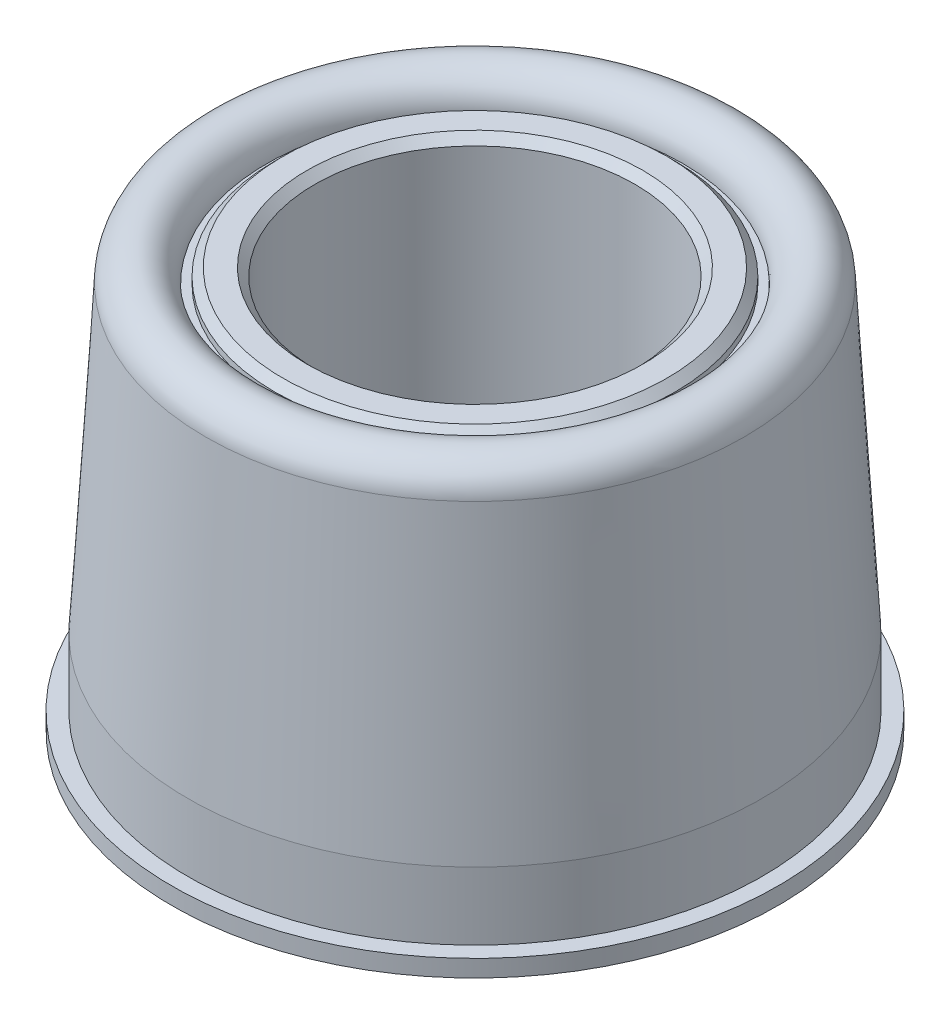
ISO-10303-21;
HEADER;
FILE_DESCRIPTION(('STEP AP214'),'2;1');
FILE_NAME('part.step','',(''),(''),'','','');
FILE_SCHEMA(('AUTOMOTIVE_DESIGN { 1 0 10303 214 1 1 1 1 }'));
ENDSEC;
DATA;
#1=APPLICATION_CONTEXT('core data for automotive mechanical design processes');
#2=APPLICATION_PROTOCOL_DEFINITION('international standard','automotive_design',2000,#1);
#3=PRODUCT_CONTEXT('',#1,'mechanical');
#4=PRODUCT('Part','Part','',(#3));
#5=PRODUCT_RELATED_PRODUCT_CATEGORY('part','',(#4));
#6=PRODUCT_DEFINITION_FORMATION('','',#4);
#7=PRODUCT_DEFINITION_CONTEXT('part definition',#1,'design');
#8=PRODUCT_DEFINITION('design','',#6,#7);
#9=PRODUCT_DEFINITION_SHAPE('','',#8);
#10=(LENGTH_UNIT() NAMED_UNIT(*) SI_UNIT(.MILLI.,.METRE.));
#11=(NAMED_UNIT(*) PLANE_ANGLE_UNIT() SI_UNIT($,.RADIAN.));
#12=(NAMED_UNIT(*) SI_UNIT($,.STERADIAN.) SOLID_ANGLE_UNIT());
#13=UNCERTAINTY_MEASURE_WITH_UNIT(LENGTH_MEASURE(1.E-05),#10,'distance_accuracy_value','');
#14=(GEOMETRIC_REPRESENTATION_CONTEXT(3) GLOBAL_UNCERTAINTY_ASSIGNED_CONTEXT((#13)) GLOBAL_UNIT_ASSIGNED_CONTEXT((#10,
#11,#12)) REPRESENTATION_CONTEXT('',''));
#15=CARTESIAN_POINT('',(0.,0.,0.));
#16=DIRECTION('',(0.,0.,1.));
#17=DIRECTION('',(1.,0.,0.));
#18=AXIS2_PLACEMENT_3D('',#15,#16,#17);
#19=CARTESIAN_POINT('',(0.,-9.0424,0.));
#20=DIRECTION('',(0.,-1.,0.));
#21=DIRECTION('',(0.,0.,-1.));
#22=AXIS2_PLACEMENT_3D('',#19,#20,#21);
#23=CYLINDRICAL_SURFACE('',#22,9.78);
#24=CARTESIAN_POINT('',(0.,-9.80000000000001,0.));
#25=DIRECTION('',(0.,-1.,0.));
#26=DIRECTION('',(0.,0.,-1.));
#27=AXIS2_PLACEMENT_3D('',#24,#25,#26);
#28=CIRCLE('',#27,9.78);
#29=CARTESIAN_POINT('',(0.,-9.80000000000001,-9.78));
#30=VERTEX_POINT('',#29);
#31=EDGE_CURVE('E41',#30,#30,#28,.T.);
#32=ORIENTED_EDGE('',*,*,#31,.T.);
#33=EDGE_LOOP('',(#32));
#34=FACE_BOUND('',#33,.T.);
#35=CARTESIAN_POINT('',(0.,-9.,0.));
#36=DIRECTION('',(0.,1.,0.));
#37=DIRECTION('',(0.,0.,1.));
#38=AXIS2_PLACEMENT_3D('',#35,#36,#37);
#39=CIRCLE('',#38,9.78);
#40=CARTESIAN_POINT('',(0.,-9.,9.78));
#41=VERTEX_POINT('',#40);
#42=EDGE_CURVE('E10',#41,#41,#39,.F.);
#43=ORIENTED_EDGE('',*,*,#42,.F.);
#44=EDGE_LOOP('',(#43));
#45=FACE_BOUND('',#44,.T.);
#46=ADVANCED_FACE('F34',(#34,#45),#23,.F.);
#47=CARTESIAN_POINT('',(-9.78,-9.8,0.));
#48=DIRECTION('',(0.,1.,0.));
#49=DIRECTION('',(0.,0.,1.));
#50=AXIS2_PLACEMENT_3D('',#47,#48,#49);
#51=PLANE('',#50);
#52=ORIENTED_EDGE('',*,*,#31,.F.);
#53=EDGE_LOOP('',(#52));
#54=FACE_BOUND('',#53,.T.);
#55=CARTESIAN_POINT('',(0.,-9.8,0.));
#56=DIRECTION('',(0.,-1.,0.));
#57=DIRECTION('',(0.,0.,-1.));
#58=AXIS2_PLACEMENT_3D('',#55,#56,#57);
#59=CIRCLE('',#58,14.25);
#60=CARTESIAN_POINT('',(0.,-9.8,-14.25));
#61=VERTEX_POINT('',#60);
#62=EDGE_CURVE('E60',#61,#61,#59,.T.);
#63=ORIENTED_EDGE('',*,*,#62,.T.);
#64=EDGE_LOOP('',(#63));
#65=FACE_BOUND('',#64,.T.);
#66=ADVANCED_FACE('F36',(#54,#65),#51,.F.);
#67=CARTESIAN_POINT('',(0.,8.36786850098123,0.));
#68=DIRECTION('',(0.,-1.,0.));
#69=DIRECTION('',(0.,0.,-1.));
#70=AXIS2_PLACEMENT_3D('',#67,#68,#69);
#71=TOROIDAL_SURFACE('',#70,11.2121314990188,1.43213149901877);
#72=CARTESIAN_POINT('',(0.,8.45280302667194,0.));
#73=DIRECTION('',(0.,-1.,0.));
#74=DIRECTION('',(0.,0.,-1.));
#75=AXIS2_PLACEMENT_3D('',#72,#73,#74);
#76=CIRCLE('',#75,12.6417422001635);
#77=CARTESIAN_POINT('',(0.,8.45280302667194,-12.6417422001635));
#78=VERTEX_POINT('',#77);
#79=EDGE_CURVE('E45',#78,#78,#76,.T.);
#80=ORIENTED_EDGE('',*,*,#79,.F.);
#81=EDGE_LOOP('',(#80));
#82=FACE_BOUND('',#81,.T.);
#83=CARTESIAN_POINT('',(0.,8.36786850098123,0.));
#84=DIRECTION('',(0.,-1.,0.));
#85=DIRECTION('',(0.,0.,-1.));
#86=AXIS2_PLACEMENT_3D('',#83,#84,#85);
#87=CIRCLE('',#86,9.78);
#88=CARTESIAN_POINT('',(0.,8.36786850098123,-9.78));
#89=VERTEX_POINT('',#88);
#90=EDGE_CURVE('E63',#89,#89,#87,.T.);
#91=ORIENTED_EDGE('',*,*,#90,.T.);
#92=EDGE_LOOP('',(#91));
#93=FACE_BOUND('',#92,.T.);
#94=ADVANCED_FACE('F138',(#82,#93),#71,.T.);
#95=CARTESIAN_POINT('',(0.,8.45280302667194,0.));
#96=DIRECTION('',(0.,-1.,0.));
#97=DIRECTION('',(0.,0.,-1.));
#98=AXIS2_PLACEMENT_3D('',#95,#96,#97);
#99=CONICAL_SURFACE('',#98,12.6417422001635,0.0593411945678073);
#100=CARTESIAN_POINT('',(0.,-5.825,0.));
#101=DIRECTION('',(0.,-1.,0.));
#102=DIRECTION('',(0.,0.,-1.));
#103=AXIS2_PLACEMENT_3D('',#100,#101,#102);
#104=CIRCLE('',#103,13.49);
#105=CARTESIAN_POINT('',(0.,-5.825,-13.49));
#106=VERTEX_POINT('',#105);
#107=EDGE_CURVE('E49',#106,#106,#104,.T.);
#108=ORIENTED_EDGE('',*,*,#107,.F.);
#109=EDGE_LOOP('',(#108));
#110=FACE_BOUND('',#109,.T.);
#111=ORIENTED_EDGE('',*,*,#79,.T.);
#112=EDGE_LOOP('',(#111));
#113=FACE_BOUND('',#112,.T.);
#114=ADVANCED_FACE('F144',(#110,#113),#99,.T.);
#115=CARTESIAN_POINT('',(0.,-9.0424,0.));
#116=DIRECTION('',(0.,-1.,0.));
#117=DIRECTION('',(0.,0.,-1.));
#118=AXIS2_PLACEMENT_3D('',#115,#116,#117);
#119=CYLINDRICAL_SURFACE('',#118,13.49);
#120=CARTESIAN_POINT('',(0.,-9.,0.));
#121=DIRECTION('',(0.,-1.,0.));
#122=DIRECTION('',(0.,0.,-1.));
#123=AXIS2_PLACEMENT_3D('',#120,#121,#122);
#124=CIRCLE('',#123,13.49);
#125=CARTESIAN_POINT('',(0.,-9.,-13.49));
#126=VERTEX_POINT('',#125);
#127=EDGE_CURVE('E54',#126,#126,#124,.T.);
#128=ORIENTED_EDGE('',*,*,#127,.F.);
#129=EDGE_LOOP('',(#128));
#130=FACE_BOUND('',#129,.T.);
#131=ORIENTED_EDGE('',*,*,#107,.T.);
#132=EDGE_LOOP('',(#131));
#133=FACE_BOUND('',#132,.T.);
#134=ADVANCED_FACE('F148',(#130,#133),#119,.T.);
#135=CARTESIAN_POINT('',(-14.25,-9.,0.));
#136=DIRECTION('',(0.,-1.,0.));
#137=DIRECTION('',(0.,0.,-1.));
#138=AXIS2_PLACEMENT_3D('',#135,#136,#137);
#139=PLANE('',#138);
#140=CARTESIAN_POINT('',(0.,-9.,0.));
#141=DIRECTION('',(0.,-1.,0.));
#142=DIRECTION('',(0.,0.,-1.));
#143=AXIS2_PLACEMENT_3D('',#140,#141,#142);
#144=CIRCLE('',#143,14.25);
#145=CARTESIAN_POINT('',(0.,-9.,-14.25));
#146=VERTEX_POINT('',#145);
#147=EDGE_CURVE('E57',#146,#146,#144,.T.);
#148=ORIENTED_EDGE('',*,*,#147,.F.);
#149=EDGE_LOOP('',(#148));
#150=FACE_BOUND('',#149,.T.);
#151=ORIENTED_EDGE('',*,*,#127,.T.);
#152=EDGE_LOOP('',(#151));
#153=FACE_BOUND('',#152,.T.);
#154=ADVANCED_FACE('F152',(#150,#153),#139,.F.);
#155=CARTESIAN_POINT('',(0.,-9.0424,0.));
#156=DIRECTION('',(0.,-1.,0.));
#157=DIRECTION('',(0.,0.,-1.));
#158=AXIS2_PLACEMENT_3D('',#155,#156,#157);
#159=CYLINDRICAL_SURFACE('',#158,14.25);
#160=ORIENTED_EDGE('',*,*,#62,.F.);
#161=EDGE_LOOP('',(#160));
#162=FACE_BOUND('',#161,.T.);
#163=ORIENTED_EDGE('',*,*,#147,.T.);
#164=EDGE_LOOP('',(#163));
#165=FACE_BOUND('',#164,.T.);
#166=ADVANCED_FACE('F156',(#162,#165),#159,.T.);
#167=CARTESIAN_POINT('',(-9.78,8.36786850098123,0.));
#168=DIRECTION('',(0.,-1.,0.));
#169=DIRECTION('',(0.,0.,-1.));
#170=AXIS2_PLACEMENT_3D('',#167,#168,#169);
#171=PLANE('',#170);
#172=ORIENTED_EDGE('',*,*,#90,.F.);
#173=EDGE_LOOP('',(#172));
#174=FACE_BOUND('',#173,.T.);
#175=CARTESIAN_POINT('',(0.,8.36786850098123,0.));
#176=DIRECTION('',(0.,-1.,0.));
#177=DIRECTION('',(0.,0.,-1.));
#178=AXIS2_PLACEMENT_3D('',#175,#176,#177);
#179=CIRCLE('',#178,9.4);
#180=CARTESIAN_POINT('',(0.,8.36786850098123,-9.4));
#181=VERTEX_POINT('',#180);
#182=EDGE_CURVE('E69',#181,#181,#179,.F.);
#183=ORIENTED_EDGE('',*,*,#182,.F.);
#184=EDGE_LOOP('',(#183));
#185=FACE_BOUND('',#184,.T.);
#186=ADVANCED_FACE('F160',(#174,#185),#171,.F.);
#187=CARTESIAN_POINT('',(0.,-9.0424,0.));
#188=DIRECTION('',(0.,-1.,0.));
#189=DIRECTION('',(0.,0.,-1.));
#190=AXIS2_PLACEMENT_3D('',#187,#188,#189);
#191=CYLINDRICAL_SURFACE('',#190,9.4);
#192=CARTESIAN_POINT('',(0.,-8.66665,0.));
#193=DIRECTION('',(0.,1.,0.));
#194=DIRECTION('',(0.,0.,1.));
#195=AXIS2_PLACEMENT_3D('',#192,#193,#194);
#196=CIRCLE('',#195,9.4);
#197=CARTESIAN_POINT('',(0.,-8.66665,9.4));
#198=VERTEX_POINT('',#197);
#199=EDGE_CURVE('E84',#198,#198,#196,.T.);
#200=ORIENTED_EDGE('',*,*,#199,.T.);
#201=EDGE_LOOP('',(#200));
#202=FACE_BOUND('',#201,.T.);
#203=CARTESIAN_POINT('',(0.,-9.,0.));
#204=DIRECTION('',(0.,-1.,0.));
#205=DIRECTION('',(0.,0.,-1.));
#206=AXIS2_PLACEMENT_3D('',#203,#204,#205);
#207=CIRCLE('',#206,9.4);
#208=CARTESIAN_POINT('',(0.,-9.,-9.4));
#209=VERTEX_POINT('',#208);
#210=EDGE_CURVE('E66',#209,#209,#207,.T.);
#211=ORIENTED_EDGE('',*,*,#210,.T.);
#212=EDGE_LOOP('',(#211));
#213=FACE_BOUND('',#212,.T.);
#214=ADVANCED_FACE('F164',(#202,#213),#191,.F.);
#215=CARTESIAN_POINT('',(-9.4,-9.,0.));
#216=DIRECTION('',(0.,1.,0.));
#217=DIRECTION('',(0.,0.,1.));
#218=AXIS2_PLACEMENT_3D('',#215,#216,#217);
#219=PLANE('',#218);
#220=ORIENTED_EDGE('',*,*,#210,.F.);
#221=EDGE_LOOP('',(#220));
#222=FACE_BOUND('',#221,.T.);
#223=ORIENTED_EDGE('',*,*,#42,.T.);
#224=EDGE_LOOP('',(#223));
#225=FACE_BOUND('',#224,.T.);
#226=ADVANCED_FACE('F130',(#222,#225),#219,.F.);
#227=CARTESIAN_POINT('',(0.,-9.0424,0.));
#228=DIRECTION('',(0.,-1.,0.));
#229=DIRECTION('',(0.,0.,-1.));
#230=AXIS2_PLACEMENT_3D('',#227,#228,#229);
#231=CYLINDRICAL_SURFACE('',#230,9.4);
#232=CARTESIAN_POINT('',(0.,8.66665000000001,0.));
#233=DIRECTION('',(0.,-1.,0.));
#234=DIRECTION('',(0.,0.,-1.));
#235=AXIS2_PLACEMENT_3D('',#232,#233,#234);
#236=CIRCLE('',#235,9.4);
#237=CARTESIAN_POINT('',(0.,8.66665000000001,-9.4));
#238=VERTEX_POINT('',#237);
#239=EDGE_CURVE('E87',#238,#238,#236,.T.);
#240=ORIENTED_EDGE('',*,*,#239,.T.);
#241=EDGE_LOOP('',(#240));
#242=FACE_BOUND('',#241,.T.);
#243=ORIENTED_EDGE('',*,*,#182,.T.);
#244=EDGE_LOOP('',(#243));
#245=FACE_BOUND('',#244,.T.);
#246=ADVANCED_FACE('F121',(#242,#245),#231,.T.);
#247=CARTESIAN_POINT('',(-7.515,9.0424,0.));
#248=DIRECTION('',(0.,-1.,0.));
#249=DIRECTION('',(0.,0.,-1.));
#250=AXIS2_PLACEMENT_3D('',#247,#248,#249);
#251=PLANE('',#250);
#252=CARTESIAN_POINT('',(0.,9.0424,0.));
#253=DIRECTION('',(0.,-1.,0.));
#254=DIRECTION('',(0.,0.,-1.));
#255=AXIS2_PLACEMENT_3D('',#252,#253,#254);
#256=CIRCLE('',#255,9.02425000000001);
#257=CARTESIAN_POINT('',(0.,9.0424,-9.02425000000001));
#258=VERTEX_POINT('',#257);
#259=EDGE_CURVE('E78',#258,#258,#256,.F.);
#260=ORIENTED_EDGE('',*,*,#259,.T.);
#261=EDGE_LOOP('',(#260));
#262=FACE_BOUND('',#261,.T.);
#263=CARTESIAN_POINT('',(0.,9.0424,0.));
#264=DIRECTION('',(0.,-1.,0.));
#265=DIRECTION('',(0.,0.,-1.));
#266=AXIS2_PLACEMENT_3D('',#263,#264,#265);
#267=CIRCLE('',#266,7.89075);
#268=CARTESIAN_POINT('',(0.,9.0424,-7.89075));
#269=VERTEX_POINT('',#268);
#270=EDGE_CURVE('E81',#269,#269,#267,.T.);
#271=ORIENTED_EDGE('',*,*,#270,.T.);
#272=EDGE_LOOP('',(#271));
#273=FACE_BOUND('',#272,.T.);
#274=ADVANCED_FACE('F119',(#262,#273),#251,.F.);
#275=CARTESIAN_POINT('',(-9.4,-9.0424,0.));
#276=DIRECTION('',(0.,1.,0.));
#277=DIRECTION('',(0.,0.,1.));
#278=AXIS2_PLACEMENT_3D('',#275,#276,#277);
#279=PLANE('',#278);
#280=CARTESIAN_POINT('',(0.,-9.0424,0.));
#281=DIRECTION('',(0.,1.,0.));
#282=DIRECTION('',(0.,0.,1.));
#283=AXIS2_PLACEMENT_3D('',#280,#281,#282);
#284=CIRCLE('',#283,9.02425000000001);
#285=CARTESIAN_POINT('',(0.,-9.0424,9.02425000000001));
#286=VERTEX_POINT('',#285);
#287=EDGE_CURVE('E90',#286,#286,#284,.F.);
#288=ORIENTED_EDGE('',*,*,#287,.T.);
#289=EDGE_LOOP('',(#288));
#290=FACE_BOUND('',#289,.T.);
#291=CARTESIAN_POINT('',(0.,-9.0424,0.));
#292=DIRECTION('',(0.,1.,0.));
#293=DIRECTION('',(0.,0.,1.));
#294=AXIS2_PLACEMENT_3D('',#291,#292,#293);
#295=CIRCLE('',#294,7.89075000000001);
#296=CARTESIAN_POINT('',(0.,-9.0424,7.89075000000001));
#297=VERTEX_POINT('',#296);
#298=EDGE_CURVE('E93',#297,#297,#295,.T.);
#299=ORIENTED_EDGE('',*,*,#298,.T.);
#300=EDGE_LOOP('',(#299));
#301=FACE_BOUND('',#300,.T.);
#302=ADVANCED_FACE('F97',(#290,#301),#279,.F.);
#303=CARTESIAN_POINT('',(0.,-9.0424,0.));
#304=DIRECTION('',(0.,-1.,0.));
#305=DIRECTION('',(0.,0.,-1.));
#306=AXIS2_PLACEMENT_3D('',#303,#304,#305);
#307=CYLINDRICAL_SURFACE('',#306,7.515);
#308=CARTESIAN_POINT('',(0.,-8.66665,0.));
#309=DIRECTION('',(0.,1.,0.));
#310=DIRECTION('',(0.,0.,1.));
#311=AXIS2_PLACEMENT_3D('',#308,#309,#310);
#312=CIRCLE('',#311,7.515);
#313=CARTESIAN_POINT('',(0.,-8.66665,7.515));
#314=VERTEX_POINT('',#313);
#315=EDGE_CURVE('E72',#314,#314,#312,.F.);
#316=ORIENTED_EDGE('',*,*,#315,.T.);
#317=EDGE_LOOP('',(#316));
#318=FACE_BOUND('',#317,.T.);
#319=CARTESIAN_POINT('',(0.,8.66665,0.));
#320=DIRECTION('',(0.,-1.,0.));
#321=DIRECTION('',(0.,0.,-1.));
#322=AXIS2_PLACEMENT_3D('',#319,#320,#321);
#323=CIRCLE('',#322,7.515);
#324=CARTESIAN_POINT('',(0.,8.66665,-7.515));
#325=VERTEX_POINT('',#324);
#326=EDGE_CURVE('E75',#325,#325,#323,.F.);
#327=ORIENTED_EDGE('',*,*,#326,.T.);
#328=EDGE_LOOP('',(#327));
#329=FACE_BOUND('',#328,.T.);
#330=ADVANCED_FACE('F107',(#318,#329),#307,.F.);
#331=CARTESIAN_POINT('',(0.,-9.0424,0.));
#332=DIRECTION('',(0.,1.,0.));
#333=DIRECTION('',(0.,0.,1.));
#334=AXIS2_PLACEMENT_3D('',#331,#332,#333);
#335=CONICAL_SURFACE('',#334,9.02425000000001,0.785398163397444);
#336=ORIENTED_EDGE('',*,*,#199,.F.);
#337=EDGE_LOOP('',(#336));
#338=FACE_BOUND('',#337,.T.);
#339=ORIENTED_EDGE('',*,*,#287,.F.);
#340=EDGE_LOOP('',(#339));
#341=FACE_BOUND('',#340,.T.);
#342=ADVANCED_FACE('F110',(#338,#341),#335,.T.);
#343=CARTESIAN_POINT('',(0.,8.66665000000001,0.));
#344=DIRECTION('',(0.,-1.,0.));
#345=DIRECTION('',(0.,0.,-1.));
#346=AXIS2_PLACEMENT_3D('',#343,#344,#345);
#347=CONICAL_SURFACE('',#346,9.4,0.785398163397453);
#348=ORIENTED_EDGE('',*,*,#259,.F.);
#349=EDGE_LOOP('',(#348));
#350=FACE_BOUND('',#349,.T.);
#351=ORIENTED_EDGE('',*,*,#239,.F.);
#352=EDGE_LOOP('',(#351));
#353=FACE_BOUND('',#352,.T.);
#354=ADVANCED_FACE('F103',(#350,#353),#347,.T.);
#355=CARTESIAN_POINT('',(0.,-8.66665,0.));
#356=DIRECTION('',(0.,-1.,0.));
#357=DIRECTION('',(0.,0.,-1.));
#358=AXIS2_PLACEMENT_3D('',#355,#356,#357);
#359=CONICAL_SURFACE('',#358,7.515,0.785398163397452);
#360=ORIENTED_EDGE('',*,*,#298,.F.);
#361=EDGE_LOOP('',(#360));
#362=FACE_BOUND('',#361,.T.);
#363=ORIENTED_EDGE('',*,*,#315,.F.);
#364=EDGE_LOOP('',(#363));
#365=FACE_BOUND('',#364,.T.);
#366=ADVANCED_FACE('F99',(#362,#365),#359,.F.);
#367=CARTESIAN_POINT('',(0.,9.0424,0.));
#368=DIRECTION('',(0.,1.,0.));
#369=DIRECTION('',(0.,0.,1.));
#370=AXIS2_PLACEMENT_3D('',#367,#368,#369);
#371=CONICAL_SURFACE('',#370,7.89075,0.785398163397447);
#372=ORIENTED_EDGE('',*,*,#326,.F.);
#373=EDGE_LOOP('',(#372));
#374=FACE_BOUND('',#373,.T.);
#375=ORIENTED_EDGE('',*,*,#270,.F.);
#376=EDGE_LOOP('',(#375));
#377=FACE_BOUND('',#376,.T.);
#378=ADVANCED_FACE('F102',(#374,#377),#371,.F.);
#379=CLOSED_SHELL('',(#46,#66,#94,#114,#134,#154,#166,#186,#214,#226,#246,#274,#302,#330,#342,
#354,#366,#378));
#380=MANIFOLD_SOLID_BREP('B2',#379);
#381=ADVANCED_BREP_SHAPE_REPRESENTATION('',(#18,#380),#14);
#382=SHAPE_DEFINITION_REPRESENTATION(#9,#381);
ENDSEC;
END-ISO-10303-21;
